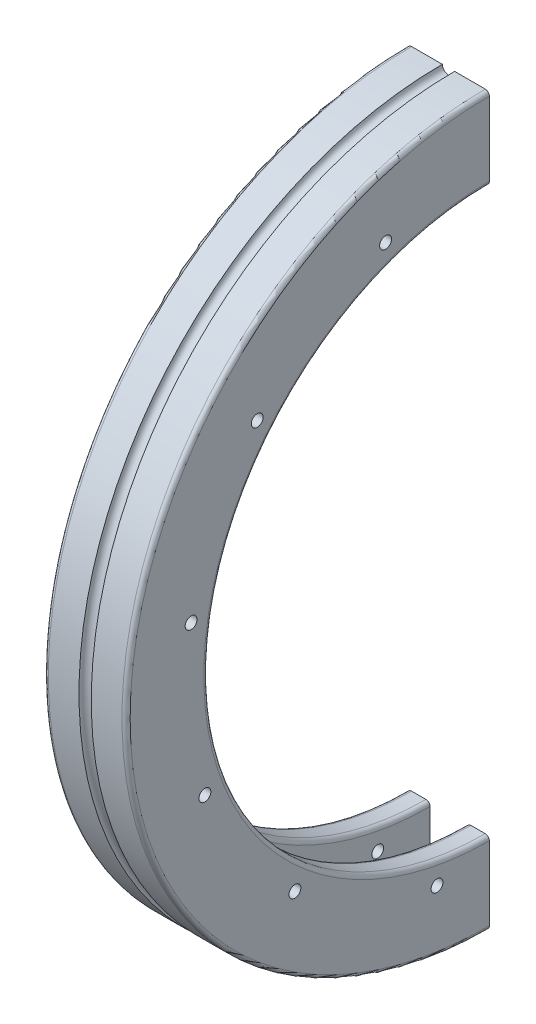
ISO-10303-21;
HEADER;
FILE_DESCRIPTION(('STEP AP214'),'2;1');
FILE_NAME('part.step','',(''),(''),'','','');
FILE_SCHEMA(('AUTOMOTIVE_DESIGN { 1 0 10303 214 1 1 1 1 }'));
ENDSEC;
DATA;
#1=APPLICATION_CONTEXT('core data for automotive mechanical design processes');
#2=APPLICATION_PROTOCOL_DEFINITION('international standard','automotive_design',2000,#1);
#3=PRODUCT_CONTEXT('',#1,'mechanical');
#4=PRODUCT('Part','Part','',(#3));
#5=PRODUCT_RELATED_PRODUCT_CATEGORY('part','',(#4));
#6=PRODUCT_DEFINITION_FORMATION('','',#4);
#7=PRODUCT_DEFINITION_CONTEXT('part definition',#1,'design');
#8=PRODUCT_DEFINITION('design','',#6,#7);
#9=PRODUCT_DEFINITION_SHAPE('','',#8);
#10=(LENGTH_UNIT() NAMED_UNIT(*) SI_UNIT(.MILLI.,.METRE.));
#11=(NAMED_UNIT(*) PLANE_ANGLE_UNIT() SI_UNIT($,.RADIAN.));
#12=(NAMED_UNIT(*) SI_UNIT($,.STERADIAN.) SOLID_ANGLE_UNIT());
#13=UNCERTAINTY_MEASURE_WITH_UNIT(LENGTH_MEASURE(1.E-05),#10,'distance_accuracy_value','');
#14=(GEOMETRIC_REPRESENTATION_CONTEXT(3) GLOBAL_UNCERTAINTY_ASSIGNED_CONTEXT((#13)) GLOBAL_UNIT_ASSIGNED_CONTEXT((#10,
#11,#12)) REPRESENTATION_CONTEXT('',''));
#15=CARTESIAN_POINT('',(0.,0.,0.));
#16=DIRECTION('',(0.,0.,1.));
#17=DIRECTION('',(1.,0.,0.));
#18=AXIS2_PLACEMENT_3D('',#15,#16,#17);
#19=CARTESIAN_POINT('',(-85.3849310544505,-58.8378893888762,0.));
#20=DIRECTION('',(-1.,0.,0.));
#21=DIRECTION('',(0.,0.,1.));
#22=AXIS2_PLACEMENT_3D('',#19,#20,#21);
#23=CYLINDRICAL_SURFACE('',#22,68.7840813761044);
#24=DIRECTION('',(1.,0.,0.));
#25=VECTOR('',#24,1.);
#26=CARTESIAN_POINT('',(-7.40458995500115,9.94619198722817,0.));
#27=LINE('',#26,#25);
#28=CARTESIAN_POINT('',(-6.40458995500115,9.94619198722817,0.));
#29=VERTEX_POINT('',#28);
#30=CARTESIAN_POINT('',(-2.90458995500115,9.94619198722817,0.));
#31=VERTEX_POINT('',#30);
#32=EDGE_CURVE('E158',#29,#31,#27,.T.);
#33=ORIENTED_EDGE('',*,*,#32,.T.);
#34=CARTESIAN_POINT('',(-2.90458995500115,-58.8378893888762,0.));
#35=DIRECTION('',(-1.,0.,0.));
#36=DIRECTION('',(0.,0.,1.));
#37=AXIS2_PLACEMENT_3D('',#34,#35,#36);
#38=CIRCLE('',#37,68.7840813761044);
#39=CARTESIAN_POINT('',(-2.90458995500115,-127.621970764981,-4.80316673068272E-13));
#40=VERTEX_POINT('',#39);
#41=EDGE_CURVE('E40',#31,#40,#38,.F.);
#42=ORIENTED_EDGE('',*,*,#41,.T.);
#43=DIRECTION('',(1.,0.,0.));
#44=VECTOR('',#43,1.);
#45=CARTESIAN_POINT('',(-7.40458995500115,-127.621970764981,-4.80316673068272E-13));
#46=LINE('',#45,#44);
#47=CARTESIAN_POINT('',(-6.40458995500115,-127.621970764981,-4.80316673068272E-13));
#48=VERTEX_POINT('',#47);
#49=EDGE_CURVE('E192',#48,#40,#46,.T.);
#50=ORIENTED_EDGE('',*,*,#49,.F.);
#51=CARTESIAN_POINT('',(-6.40458995500115,-58.8378893888762,0.));
#52=DIRECTION('',(1.,0.,0.));
#53=DIRECTION('',(0.,0.,-1.));
#54=AXIS2_PLACEMENT_3D('',#51,#52,#53);
#55=CIRCLE('',#54,68.7840813761044);
#56=EDGE_CURVE('E265',#48,#29,#55,.F.);
#57=ORIENTED_EDGE('',*,*,#56,.T.);
#58=EDGE_LOOP('',(#33,#42,#50,#57));
#59=FACE_BOUND('',#58,.T.);
#60=ADVANCED_FACE('F32',(#59),#23,.F.);
#61=CARTESIAN_POINT('',(-1.90458995500115,-127.621970764981,-4.80316673068272E-13));
#62=DIRECTION('',(-1.,0.,0.));
#63=DIRECTION('',(0.,0.,1.));
#64=AXIS2_PLACEMENT_3D('',#61,#62,#63);
#65=PLANE('',#64);
#66=CARTESIAN_POINT('',(-1.90458995500115,-131.72368400921,12.7911015660898));
#67=DIRECTION('',(-1.,0.,0.));
#68=DIRECTION('',(0.,0.,1.));
#69=AXIS2_PLACEMENT_3D('',#66,#67,#68);
#70=CIRCLE('',#69,1.45000000000001);
#71=CARTESIAN_POINT('',(-1.90458995500115,-131.72368400921,14.2411015660898));
#72=VERTEX_POINT('',#71);
#73=EDGE_CURVE('E339',#72,#72,#70,.T.);
#74=ORIENTED_EDGE('',*,*,#73,.T.);
#75=EDGE_LOOP('',(#74));
#76=FACE_BOUND('',#75,.T.);
#77=CARTESIAN_POINT('',(-1.90458995500115,-84.2032213989773,69.5169039305136));
#78=DIRECTION('',(-1.,0.,0.));
#79=DIRECTION('',(0.,0.,1.));
#80=AXIS2_PLACEMENT_3D('',#77,#78,#79);
#81=CIRCLE('',#80,1.45);
#82=CARTESIAN_POINT('',(-1.90458995500115,-84.2032213989773,70.9669039305136));
#83=VERTEX_POINT('',#82);
#84=EDGE_CURVE('E327',#83,#83,#81,.T.);
#85=ORIENTED_EDGE('',*,*,#84,.T.);
#86=EDGE_LOOP('',(#85));
#87=FACE_BOUND('',#86,.T.);
#88=CARTESIAN_POINT('',(-1.90458995500115,-11.3171642972111,56.7254853373894));
#89=DIRECTION('',(-1.,0.,0.));
#90=DIRECTION('',(0.,0.,1.));
#91=AXIS2_PLACEMENT_3D('',#88,#89,#90);
#92=CIRCLE('',#91,1.45);
#93=CARTESIAN_POINT('',(-1.90458995500115,-11.3171642972111,58.1754853373894));
#94=VERTEX_POINT('',#93);
#95=EDGE_CURVE('E315',#94,#94,#92,.T.);
#96=ORIENTED_EDGE('',*,*,#95,.T.);
#97=EDGE_LOOP('',(#96));
#98=FACE_BOUND('',#97,.T.);
#99=CARTESIAN_POINT('',(-1.90458995500115,-46.0464247322688,72.8860647307753));
#100=DIRECTION('',(-1.,0.,0.));
#101=DIRECTION('',(0.,0.,1.));
#102=AXIS2_PLACEMENT_3D('',#99,#100,#101);
#103=CIRCLE('',#102,1.45);
#104=CARTESIAN_POINT('',(-1.90458995500115,-46.0464247322688,74.3360647307753));
#105=VERTEX_POINT('',#104);
#106=EDGE_CURVE('E303',#105,#105,#103,.T.);
#107=ORIENTED_EDGE('',*,*,#106,.T.);
#108=EDGE_LOOP('',(#107));
#109=FACE_BOUND('',#108,.T.);
#110=CARTESIAN_POINT('',(-1.90458995500115,-115.563436335731,47.5206515483554));
#111=DIRECTION('',(-1.,0.,0.));
#112=DIRECTION('',(0.,0.,1.));
#113=AXIS2_PLACEMENT_3D('',#110,#111,#112);
#114=CIRCLE('',#113,1.45000000000001);
#115=CARTESIAN_POINT('',(-1.90458995500115,-115.563436335731,48.9706515483554));
#116=VERTEX_POINT('',#115);
#117=EDGE_CURVE('E291',#116,#116,#114,.T.);
#118=ORIENTED_EDGE('',*,*,#117,.T.);
#119=EDGE_LOOP('',(#118));
#120=FACE_BOUND('',#119,.T.);
#121=CARTESIAN_POINT('',(-1.90458995500115,10.678964919648,25.3654680037135));
#122=DIRECTION('',(-1.,0.,0.));
#123=DIRECTION('',(0.,0.,1.));
#124=AXIS2_PLACEMENT_3D('',#121,#122,#123);
#125=CIRCLE('',#124,1.45);
#126=CARTESIAN_POINT('',(-1.90458995500115,10.678964919648,26.8154680037135));
#127=VERTEX_POINT('',#126);
#128=EDGE_CURVE('E278',#127,#127,#125,.T.);
#129=ORIENTED_EDGE('',*,*,#128,.T.);
#130=EDGE_LOOP('',(#129));
#131=FACE_BOUND('',#130,.T.);
#132=DIRECTION('',(0.,-1.,0.));
#133=VECTOR('',#132,1.);
#134=CARTESIAN_POINT('',(-1.90458995500115,-127.621970764981,-4.80316673068272E-13));
#135=LINE('',#134,#133);
#136=CARTESIAN_POINT('',(-1.90458995500115,-128.621970764981,-4.87299635745958E-13));
#137=VERTEX_POINT('',#136);
#138=CARTESIAN_POINT('',(-1.90458995500115,-138.837889388876,-5.58637014214901E-13));
#139=VERTEX_POINT('',#138);
#140=EDGE_CURVE('E194',#137,#139,#135,.T.);
#141=ORIENTED_EDGE('',*,*,#140,.F.);
#142=CARTESIAN_POINT('',(-1.90458995500115,-58.8378893888762,0.));
#143=DIRECTION('',(-1.,0.,0.));
#144=DIRECTION('',(0.,0.,1.));
#145=AXIS2_PLACEMENT_3D('',#142,#143,#144);
#146=CIRCLE('',#145,69.7840813761044);
#147=CARTESIAN_POINT('',(-1.90458995500115,10.9461919872282,0.));
#148=VERTEX_POINT('',#147);
#149=EDGE_CURVE('E154',#137,#148,#146,.T.);
#150=ORIENTED_EDGE('',*,*,#149,.T.);
#151=DIRECTION('',(0.,1.,0.));
#152=VECTOR('',#151,1.);
#153=CARTESIAN_POINT('',(-1.90458995500115,9.94619198722817,0.));
#154=LINE('',#153,#152);
#155=CARTESIAN_POINT('',(-1.90458995500115,21.1621106111238,0.));
#156=VERTEX_POINT('',#155);
#157=EDGE_CURVE('E148',#148,#156,#154,.T.);
#158=ORIENTED_EDGE('',*,*,#157,.T.);
#159=CARTESIAN_POINT('',(-1.90458995500115,-58.8378893888762,0.));
#160=DIRECTION('',(-1.,0.,0.));
#161=DIRECTION('',(0.,0.,1.));
#162=AXIS2_PLACEMENT_3D('',#159,#160,#161);
#163=CIRCLE('',#162,80.);
#164=EDGE_CURVE('E151',#139,#156,#163,.T.);
#165=ORIENTED_EDGE('',*,*,#164,.F.);
#166=EDGE_LOOP('',(#141,#150,#158,#165));
#167=FACE_BOUND('',#166,.T.);
#168=ADVANCED_FACE('F150',(#76,#87,#98,#109,#120,#131,#167),#65,.F.);
#169=CARTESIAN_POINT('',(-85.3849310544505,-58.8378893888762,0.));
#170=DIRECTION('',(-1.,0.,0.));
#171=DIRECTION('',(0.,0.,1.));
#172=AXIS2_PLACEMENT_3D('',#169,#170,#171);
#173=CYLINDRICAL_SURFACE('',#172,80.);
#174=CARTESIAN_POINT('',(7.09541004499885,-58.8378893888762,0.));
#175=DIRECTION('',(-1.,0.,0.));
#176=DIRECTION('',(0.,0.,1.));
#177=AXIS2_PLACEMENT_3D('',#174,#175,#176);
#178=CIRCLE('',#177,80.);
#179=CARTESIAN_POINT('',(7.09541004499885,-138.837889388876,-5.58637014214901E-13));
#180=VERTEX_POINT('',#179);
#181=CARTESIAN_POINT('',(7.09541004499885,21.1621106111238,0.));
#182=VERTEX_POINT('',#181);
#183=EDGE_CURVE('E167',#180,#182,#178,.T.);
#184=ORIENTED_EDGE('',*,*,#183,.F.);
#185=DIRECTION('',(1.,0.,0.));
#186=VECTOR('',#185,1.);
#187=CARTESIAN_POINT('',(-1.90458995500115,-138.837889388876,-5.58637014214901E-13));
#188=LINE('',#187,#186);
#189=EDGE_CURVE('E165',#139,#180,#188,.T.);
#190=ORIENTED_EDGE('',*,*,#189,.F.);
#191=ORIENTED_EDGE('',*,*,#164,.T.);
#192=DIRECTION('',(1.,0.,0.));
#193=VECTOR('',#192,1.);
#194=CARTESIAN_POINT('',(-1.90458995500115,21.1621106111238,0.));
#195=LINE('',#194,#193);
#196=EDGE_CURVE('E157',#156,#182,#195,.T.);
#197=ORIENTED_EDGE('',*,*,#196,.T.);
#198=EDGE_LOOP('',(#184,#190,#191,#197));
#199=FACE_BOUND('',#198,.T.);
#200=ADVANCED_FACE('F162',(#199),#173,.F.);
#201=CARTESIAN_POINT('',(7.09541004499885,-138.837889388876,-5.58637014214901E-13));
#202=DIRECTION('',(1.,0.,0.));
#203=DIRECTION('',(0.,0.,-1.));
#204=AXIS2_PLACEMENT_3D('',#201,#202,#203);
#205=PLANE('',#204);
#206=CARTESIAN_POINT('',(7.09541004499885,-131.72368400921,12.7911015660898));
#207=DIRECTION('',(1.,0.,0.));
#208=DIRECTION('',(0.,0.,-1.));
#209=AXIS2_PLACEMENT_3D('',#206,#207,#208);
#210=CIRCLE('',#209,1.45000000000001);
#211=CARTESIAN_POINT('',(7.09541004499885,-131.72368400921,11.3411015660898));
#212=VERTEX_POINT('',#211);
#213=EDGE_CURVE('E342',#212,#212,#210,.T.);
#214=ORIENTED_EDGE('',*,*,#213,.T.);
#215=EDGE_LOOP('',(#214));
#216=FACE_BOUND('',#215,.T.);
#217=CARTESIAN_POINT('',(7.09541004499885,-84.2032213989773,69.5169039305136));
#218=DIRECTION('',(1.,0.,0.));
#219=DIRECTION('',(0.,0.,-1.));
#220=AXIS2_PLACEMENT_3D('',#217,#218,#219);
#221=CIRCLE('',#220,1.45);
#222=CARTESIAN_POINT('',(7.09541004499885,-84.2032213989773,68.0669039305136));
#223=VERTEX_POINT('',#222);
#224=EDGE_CURVE('E330',#223,#223,#221,.T.);
#225=ORIENTED_EDGE('',*,*,#224,.T.);
#226=EDGE_LOOP('',(#225));
#227=FACE_BOUND('',#226,.T.);
#228=CARTESIAN_POINT('',(7.09541004499885,-11.3171642972111,56.7254853373894));
#229=DIRECTION('',(1.,0.,0.));
#230=DIRECTION('',(0.,0.,-1.));
#231=AXIS2_PLACEMENT_3D('',#228,#229,#230);
#232=CIRCLE('',#231,1.45);
#233=CARTESIAN_POINT('',(7.09541004499885,-11.3171642972111,55.2754853373894));
#234=VERTEX_POINT('',#233);
#235=EDGE_CURVE('E318',#234,#234,#232,.T.);
#236=ORIENTED_EDGE('',*,*,#235,.T.);
#237=EDGE_LOOP('',(#236));
#238=FACE_BOUND('',#237,.T.);
#239=CARTESIAN_POINT('',(7.09541004499885,-46.0464247322688,72.8860647307753));
#240=DIRECTION('',(1.,0.,0.));
#241=DIRECTION('',(0.,0.,-1.));
#242=AXIS2_PLACEMENT_3D('',#239,#240,#241);
#243=CIRCLE('',#242,1.45);
#244=CARTESIAN_POINT('',(7.09541004499885,-46.0464247322688,71.4360647307753));
#245=VERTEX_POINT('',#244);
#246=EDGE_CURVE('E306',#245,#245,#243,.T.);
#247=ORIENTED_EDGE('',*,*,#246,.T.);
#248=EDGE_LOOP('',(#247));
#249=FACE_BOUND('',#248,.T.);
#250=CARTESIAN_POINT('',(7.09541004499885,-115.563436335731,47.5206515483554));
#251=DIRECTION('',(1.,0.,0.));
#252=DIRECTION('',(0.,0.,-1.));
#253=AXIS2_PLACEMENT_3D('',#250,#251,#252);
#254=CIRCLE('',#253,1.45000000000001);
#255=CARTESIAN_POINT('',(7.09541004499885,-115.563436335731,46.0706515483554));
#256=VERTEX_POINT('',#255);
#257=EDGE_CURVE('E294',#256,#256,#254,.T.);
#258=ORIENTED_EDGE('',*,*,#257,.T.);
#259=EDGE_LOOP('',(#258));
#260=FACE_BOUND('',#259,.T.);
#261=CARTESIAN_POINT('',(7.09541004499885,10.678964919648,25.3654680037135));
#262=DIRECTION('',(1.,0.,0.));
#263=DIRECTION('',(0.,0.,-1.));
#264=AXIS2_PLACEMENT_3D('',#261,#262,#263);
#265=CIRCLE('',#264,1.45);
#266=CARTESIAN_POINT('',(7.09541004499885,10.678964919648,23.9154680037135));
#267=VERTEX_POINT('',#266);
#268=EDGE_CURVE('E280',#267,#267,#265,.T.);
#269=ORIENTED_EDGE('',*,*,#268,.T.);
#270=EDGE_LOOP('',(#269));
#271=FACE_BOUND('',#270,.T.);
#272=DIRECTION('',(0.,-1.,0.));
#273=VECTOR('',#272,1.);
#274=CARTESIAN_POINT('',(7.09541004499885,21.1621106111238,0.));
#275=LINE('',#274,#273);
#276=CARTESIAN_POINT('',(7.09541004499886,10.9461919872282,0.));
#277=VERTEX_POINT('',#276);
#278=EDGE_CURVE('E171',#182,#277,#275,.T.);
#279=ORIENTED_EDGE('',*,*,#278,.T.);
#280=CARTESIAN_POINT('',(7.09541004499885,-58.8378893888762,0.));
#281=DIRECTION('',(1.,0.,0.));
#282=DIRECTION('',(0.,0.,-1.));
#283=AXIS2_PLACEMENT_3D('',#280,#281,#282);
#284=CIRCLE('',#283,69.7840813761044);
#285=CARTESIAN_POINT('',(7.09541004499886,-128.621970764981,-4.87299635745958E-13));
#286=VERTEX_POINT('',#285);
#287=EDGE_CURVE('E47',#277,#286,#284,.T.);
#288=ORIENTED_EDGE('',*,*,#287,.T.);
#289=DIRECTION('',(0.,1.,0.));
#290=VECTOR('',#289,1.);
#291=CARTESIAN_POINT('',(7.09541004499885,-138.837889388876,-5.58637014214901E-13));
#292=LINE('',#291,#290);
#293=EDGE_CURVE('E197',#180,#286,#292,.T.);
#294=ORIENTED_EDGE('',*,*,#293,.F.);
#295=ORIENTED_EDGE('',*,*,#183,.T.);
#296=EDGE_LOOP('',(#279,#288,#294,#295));
#297=FACE_BOUND('',#296,.T.);
#298=ADVANCED_FACE('F408',(#216,#227,#238,#249,#260,#271,#297),#205,.F.);
#299=CARTESIAN_POINT('',(-85.3849310544505,-58.8378893888762,0.));
#300=DIRECTION('',(-1.,0.,0.));
#301=DIRECTION('',(0.,0.,1.));
#302=AXIS2_PLACEMENT_3D('',#299,#300,#301);
#303=CYLINDRICAL_SURFACE('',#302,68.7840813761044);
#304=DIRECTION('',(1.,0.,0.));
#305=VECTOR('',#304,1.);
#306=CARTESIAN_POINT('',(7.09541004499886,9.94619198722817,0.));
#307=LINE('',#306,#305);
#308=CARTESIAN_POINT('',(8.09541004499885,9.94619198722817,0.));
#309=VERTEX_POINT('',#308);
#310=CARTESIAN_POINT('',(11.5954100449989,9.94619198722816,0.));
#311=VERTEX_POINT('',#310);
#312=EDGE_CURVE('E173',#309,#311,#307,.T.);
#313=ORIENTED_EDGE('',*,*,#312,.T.);
#314=CARTESIAN_POINT('',(11.5954100449989,-58.8378893888762,0.));
#315=DIRECTION('',(-1.,0.,0.));
#316=DIRECTION('',(0.,0.,1.));
#317=AXIS2_PLACEMENT_3D('',#314,#315,#316);
#318=CIRCLE('',#317,68.7840813761044);
#319=CARTESIAN_POINT('',(11.5954100449989,-127.621970764981,-4.80316673068272E-13));
#320=VERTEX_POINT('',#319);
#321=EDGE_CURVE('E254',#311,#320,#318,.F.);
#322=ORIENTED_EDGE('',*,*,#321,.T.);
#323=DIRECTION('',(1.,0.,0.));
#324=VECTOR('',#323,1.);
#325=CARTESIAN_POINT('',(7.09541004499886,-127.621970764981,-4.80316673068272E-13));
#326=LINE('',#325,#324);
#327=CARTESIAN_POINT('',(8.09541004499885,-127.621970764981,-4.80316673068272E-13));
#328=VERTEX_POINT('',#327);
#329=EDGE_CURVE('E199',#328,#320,#326,.T.);
#330=ORIENTED_EDGE('',*,*,#329,.F.);
#331=CARTESIAN_POINT('',(8.09541004499885,-58.8378893888762,0.));
#332=DIRECTION('',(1.,0.,0.));
#333=DIRECTION('',(0.,0.,-1.));
#334=AXIS2_PLACEMENT_3D('',#331,#332,#333);
#335=CIRCLE('',#334,68.7840813761044);
#336=EDGE_CURVE('E251',#328,#309,#335,.F.);
#337=ORIENTED_EDGE('',*,*,#336,.T.);
#338=EDGE_LOOP('',(#313,#322,#330,#337));
#339=FACE_BOUND('',#338,.T.);
#340=ADVANCED_FACE('F404',(#339),#303,.F.);
#341=CARTESIAN_POINT('',(12.5954100449989,-127.621970764981,-4.80316673068272E-13));
#342=DIRECTION('',(-1.,0.,0.));
#343=DIRECTION('',(0.,0.,1.));
#344=AXIS2_PLACEMENT_3D('',#341,#342,#343);
#345=PLANE('',#344);
#346=CARTESIAN_POINT('',(12.5954100449989,-131.72368400921,12.7911015660898));
#347=DIRECTION('',(-1.,0.,0.));
#348=DIRECTION('',(0.,0.,1.));
#349=AXIS2_PLACEMENT_3D('',#346,#347,#348);
#350=CIRCLE('',#349,1.45000000000001);
#351=CARTESIAN_POINT('',(12.5954100449989,-131.72368400921,14.2411015660898));
#352=VERTEX_POINT('',#351);
#353=EDGE_CURVE('E345',#352,#352,#350,.T.);
#354=ORIENTED_EDGE('',*,*,#353,.T.);
#355=EDGE_LOOP('',(#354));
#356=FACE_BOUND('',#355,.T.);
#357=CARTESIAN_POINT('',(12.5954100449989,-84.2032213989773,69.5169039305136));
#358=DIRECTION('',(-1.,0.,0.));
#359=DIRECTION('',(0.,0.,1.));
#360=AXIS2_PLACEMENT_3D('',#357,#358,#359);
#361=CIRCLE('',#360,1.45);
#362=CARTESIAN_POINT('',(12.5954100449989,-84.2032213989773,70.9669039305136));
#363=VERTEX_POINT('',#362);
#364=EDGE_CURVE('E333',#363,#363,#361,.T.);
#365=ORIENTED_EDGE('',*,*,#364,.T.);
#366=EDGE_LOOP('',(#365));
#367=FACE_BOUND('',#366,.T.);
#368=CARTESIAN_POINT('',(12.5954100449989,-11.3171642972111,56.7254853373894));
#369=DIRECTION('',(-1.,0.,0.));
#370=DIRECTION('',(0.,0.,1.));
#371=AXIS2_PLACEMENT_3D('',#368,#369,#370);
#372=CIRCLE('',#371,1.45);
#373=CARTESIAN_POINT('',(12.5954100449989,-11.3171642972111,58.1754853373894));
#374=VERTEX_POINT('',#373);
#375=EDGE_CURVE('E321',#374,#374,#372,.T.);
#376=ORIENTED_EDGE('',*,*,#375,.T.);
#377=EDGE_LOOP('',(#376));
#378=FACE_BOUND('',#377,.T.);
#379=CARTESIAN_POINT('',(12.5954100449989,-46.0464247322688,72.8860647307753));
#380=DIRECTION('',(-1.,0.,0.));
#381=DIRECTION('',(0.,0.,1.));
#382=AXIS2_PLACEMENT_3D('',#379,#380,#381);
#383=CIRCLE('',#382,1.45);
#384=CARTESIAN_POINT('',(12.5954100449989,-46.0464247322688,74.3360647307753));
#385=VERTEX_POINT('',#384);
#386=EDGE_CURVE('E309',#385,#385,#383,.T.);
#387=ORIENTED_EDGE('',*,*,#386,.T.);
#388=EDGE_LOOP('',(#387));
#389=FACE_BOUND('',#388,.T.);
#390=CARTESIAN_POINT('',(12.5954100449989,-115.563436335731,47.5206515483554));
#391=DIRECTION('',(-1.,0.,0.));
#392=DIRECTION('',(0.,0.,1.));
#393=AXIS2_PLACEMENT_3D('',#390,#391,#392);
#394=CIRCLE('',#393,1.45000000000001);
#395=CARTESIAN_POINT('',(12.5954100449989,-115.563436335731,48.9706515483554));
#396=VERTEX_POINT('',#395);
#397=EDGE_CURVE('E297',#396,#396,#394,.T.);
#398=ORIENTED_EDGE('',*,*,#397,.T.);
#399=EDGE_LOOP('',(#398));
#400=FACE_BOUND('',#399,.T.);
#401=CARTESIAN_POINT('',(12.5954100449989,10.678964919648,25.3654680037135));
#402=DIRECTION('',(-1.,0.,0.));
#403=DIRECTION('',(0.,0.,1.));
#404=AXIS2_PLACEMENT_3D('',#401,#402,#403);
#405=CIRCLE('',#404,1.45);
#406=CARTESIAN_POINT('',(12.5954100449989,10.678964919648,26.8154680037135));
#407=VERTEX_POINT('',#406);
#408=EDGE_CURVE('E285',#407,#407,#405,.T.);
#409=ORIENTED_EDGE('',*,*,#408,.T.);
#410=EDGE_LOOP('',(#409));
#411=FACE_BOUND('',#410,.T.);
#412=DIRECTION('',(0.,-1.,0.));
#413=VECTOR('',#412,1.);
#414=CARTESIAN_POINT('',(12.5954100449989,-127.621970764981,-4.80316673068272E-13));
#415=LINE('',#414,#413);
#416=CARTESIAN_POINT('',(12.5954100449989,-128.621970764981,-4.87299635745958E-13));
#417=VERTEX_POINT('',#416);
#418=CARTESIAN_POINT('',(12.5954100449989,-146.621970764981,-6.12992963944311E-13));
#419=VERTEX_POINT('',#418);
#420=EDGE_CURVE('E202',#417,#419,#415,.T.);
#421=ORIENTED_EDGE('',*,*,#420,.F.);
#422=CARTESIAN_POINT('',(12.5954100449989,-58.8378893888762,0.));
#423=DIRECTION('',(-1.,0.,0.));
#424=DIRECTION('',(0.,0.,1.));
#425=AXIS2_PLACEMENT_3D('',#422,#423,#424);
#426=CIRCLE('',#425,69.7840813761044);
#427=CARTESIAN_POINT('',(12.5954100449989,10.9461919872282,0.));
#428=VERTEX_POINT('',#427);
#429=EDGE_CURVE('E240',#417,#428,#426,.T.);
#430=ORIENTED_EDGE('',*,*,#429,.T.);
#431=DIRECTION('',(0.,1.,0.));
#432=VECTOR('',#431,1.);
#433=CARTESIAN_POINT('',(12.5954100449989,9.94619198722816,0.));
#434=LINE('',#433,#432);
#435=CARTESIAN_POINT('',(12.5954100449989,28.9461919872282,0.));
#436=VERTEX_POINT('',#435);
#437=EDGE_CURVE('E179',#428,#436,#434,.T.);
#438=ORIENTED_EDGE('',*,*,#437,.T.);
#439=CARTESIAN_POINT('',(12.5954100449989,-58.8378893888762,0.));
#440=DIRECTION('',(-1.,0.,0.));
#441=DIRECTION('',(0.,0.,1.));
#442=AXIS2_PLACEMENT_3D('',#439,#440,#441);
#443=CIRCLE('',#442,87.7840813761044);
#444=EDGE_CURVE('E226',#436,#419,#443,.F.);
#445=ORIENTED_EDGE('',*,*,#444,.T.);
#446=EDGE_LOOP('',(#421,#430,#438,#445));
#447=FACE_BOUND('',#446,.T.);
#448=ADVANCED_FACE('F400',(#356,#367,#378,#389,#400,#411,#447),#345,.F.);
#449=CARTESIAN_POINT('',(-85.3849310544505,-58.8378893888762,0.));
#450=DIRECTION('',(-1.,0.,0.));
#451=DIRECTION('',(0.,0.,1.));
#452=AXIS2_PLACEMENT_3D('',#449,#450,#451);
#453=CYLINDRICAL_SURFACE('',#452,88.7840813761044);
#454=DIRECTION('',(-1.,0.,0.));
#455=VECTOR('',#454,1.);
#456=CARTESIAN_POINT('',(4.09541004499885,-147.621970764981,-6.19975926621997E-13));
#457=LINE('',#456,#455);
#458=CARTESIAN_POINT('',(11.5954100449989,-147.621970764981,-6.19975926621997E-13));
#459=VERTEX_POINT('',#458);
#460=CARTESIAN_POINT('',(4.09541004499885,-147.621970764981,-6.19975926621997E-13));
#461=VERTEX_POINT('',#460);
#462=EDGE_CURVE('E204',#459,#461,#457,.T.);
#463=ORIENTED_EDGE('',*,*,#462,.F.);
#464=CARTESIAN_POINT('',(11.5954100449989,-58.8378893888762,0.));
#465=DIRECTION('',(-1.,0.,0.));
#466=DIRECTION('',(0.,0.,1.));
#467=AXIS2_PLACEMENT_3D('',#464,#465,#466);
#468=CIRCLE('',#467,88.7840813761044);
#469=CARTESIAN_POINT('',(11.5954100449989,29.9461919872282,0.));
#470=VERTEX_POINT('',#469);
#471=EDGE_CURVE('E166',#459,#470,#468,.T.);
#472=ORIENTED_EDGE('',*,*,#471,.T.);
#473=DIRECTION('',(-1.,0.,0.));
#474=VECTOR('',#473,1.);
#475=CARTESIAN_POINT('',(4.09541004499885,29.9461919872282,0.));
#476=LINE('',#475,#474);
#477=CARTESIAN_POINT('',(4.09541004499885,29.9461919872282,0.));
#478=VERTEX_POINT('',#477);
#479=EDGE_CURVE('E181',#470,#478,#476,.T.);
#480=ORIENTED_EDGE('',*,*,#479,.T.);
#481=CARTESIAN_POINT('',(4.09541004499886,-58.8378893888762,0.));
#482=DIRECTION('',(-1.,0.,0.));
#483=DIRECTION('',(0.,0.,1.));
#484=AXIS2_PLACEMENT_3D('',#481,#482,#483);
#485=CIRCLE('',#484,88.7840813761044);
#486=EDGE_CURVE('E217',#461,#478,#485,.T.);
#487=ORIENTED_EDGE('',*,*,#486,.F.);
#488=EDGE_LOOP('',(#463,#472,#480,#487));
#489=FACE_BOUND('',#488,.T.);
#490=ADVANCED_FACE('F396',(#489),#453,.T.);
#491=CARTESIAN_POINT('',(2.59541004499885,-58.8378893888762,0.));
#492=DIRECTION('',(-1.,0.,0.));
#493=DIRECTION('',(0.,0.,1.));
#494=AXIS2_PLACEMENT_3D('',#491,#492,#493);
#495=TOROIDAL_SURFACE('',#494,88.7840813761044,1.5);
#496=CARTESIAN_POINT('',(1.09541004499886,-58.8378893888762,0.));
#497=DIRECTION('',(-1.,0.,0.));
#498=DIRECTION('',(0.,0.,1.));
#499=AXIS2_PLACEMENT_3D('',#496,#497,#498);
#500=CIRCLE('',#499,88.7840813761044);
#501=CARTESIAN_POINT('',(1.09541004499885,-147.621970764981,-6.19975926621997E-13));
#502=VERTEX_POINT('',#501);
#503=CARTESIAN_POINT('',(1.09541004499885,29.9461919872282,0.));
#504=VERTEX_POINT('',#503);
#505=EDGE_CURVE('E215',#502,#504,#500,.T.);
#506=ORIENTED_EDGE('',*,*,#505,.F.);
#507=CARTESIAN_POINT('',(2.59541004499885,-147.621970764981,-6.19975926621997E-13));
#508=DIRECTION('',(0.,0.,1.));
#509=DIRECTION('',(1.,0.,0.));
#510=AXIS2_PLACEMENT_3D('',#507,#508,#509);
#511=CIRCLE('',#510,1.5);
#512=EDGE_CURVE('E206',#461,#502,#511,.T.);
#513=ORIENTED_EDGE('',*,*,#512,.F.);
#514=ORIENTED_EDGE('',*,*,#486,.T.);
#515=CARTESIAN_POINT('',(2.59541004499885,29.9461919872282,0.));
#516=DIRECTION('',(0.,0.,-1.));
#517=DIRECTION('',(1.,0.,0.));
#518=AXIS2_PLACEMENT_3D('',#515,#516,#517);
#519=CIRCLE('',#518,1.5);
#520=EDGE_CURVE('E183',#478,#504,#519,.T.);
#521=ORIENTED_EDGE('',*,*,#520,.T.);
#522=EDGE_LOOP('',(#506,#513,#514,#521));
#523=FACE_BOUND('',#522,.T.);
#524=ADVANCED_FACE('F392',(#523),#495,.F.);
#525=CARTESIAN_POINT('',(-85.3849310544505,-58.8378893888762,0.));
#526=DIRECTION('',(-1.,0.,0.));
#527=DIRECTION('',(0.,0.,1.));
#528=AXIS2_PLACEMENT_3D('',#525,#526,#527);
#529=CYLINDRICAL_SURFACE('',#528,88.7840813761044);
#530=DIRECTION('',(-1.,0.,0.));
#531=VECTOR('',#530,1.);
#532=CARTESIAN_POINT('',(-7.40458995500115,29.9461919872282,0.));
#533=LINE('',#532,#531);
#534=CARTESIAN_POINT('',(-6.40458995500115,29.9461919872282,0.));
#535=VERTEX_POINT('',#534);
#536=EDGE_CURVE('E186',#504,#535,#533,.T.);
#537=ORIENTED_EDGE('',*,*,#536,.T.);
#538=CARTESIAN_POINT('',(-6.40458995500115,-58.8378893888762,0.));
#539=DIRECTION('',(1.,0.,0.));
#540=DIRECTION('',(0.,0.,-1.));
#541=AXIS2_PLACEMENT_3D('',#538,#539,#540);
#542=CIRCLE('',#541,88.7840813761044);
#543=CARTESIAN_POINT('',(-6.40458995500115,-147.621970764981,-6.19975926621997E-13));
#544=VERTEX_POINT('',#543);
#545=EDGE_CURVE('E236',#535,#544,#542,.T.);
#546=ORIENTED_EDGE('',*,*,#545,.T.);
#547=DIRECTION('',(-1.,0.,0.));
#548=VECTOR('',#547,1.);
#549=CARTESIAN_POINT('',(-7.40458995500115,-147.621970764981,-6.19975926621997E-13));
#550=LINE('',#549,#548);
#551=EDGE_CURVE('E209',#502,#544,#550,.T.);
#552=ORIENTED_EDGE('',*,*,#551,.F.);
#553=ORIENTED_EDGE('',*,*,#505,.T.);
#554=EDGE_LOOP('',(#537,#546,#552,#553));
#555=FACE_BOUND('',#554,.T.);
#556=ADVANCED_FACE('F358',(#555),#529,.T.);
#557=CARTESIAN_POINT('',(-7.40458995500115,-127.621970764981,-4.80316673068272E-13));
#558=DIRECTION('',(1.,0.,0.));
#559=DIRECTION('',(0.,0.,-1.));
#560=AXIS2_PLACEMENT_3D('',#557,#558,#559);
#561=PLANE('',#560);
#562=CARTESIAN_POINT('',(-7.40458995500115,-131.72368400921,12.7911015660898));
#563=DIRECTION('',(-1.,0.,0.));
#564=DIRECTION('',(0.,0.,1.));
#565=AXIS2_PLACEMENT_3D('',#562,#563,#564);
#566=CIRCLE('',#565,1.45000000000001);
#567=CARTESIAN_POINT('',(-7.40458995500115,-131.72368400921,14.2411015660898));
#568=VERTEX_POINT('',#567);
#569=EDGE_CURVE('E348',#568,#568,#566,.T.);
#570=ORIENTED_EDGE('',*,*,#569,.F.);
#571=EDGE_LOOP('',(#570));
#572=FACE_BOUND('',#571,.T.);
#573=CARTESIAN_POINT('',(-7.40458995500115,-84.2032213989773,69.5169039305136));
#574=DIRECTION('',(-1.,0.,0.));
#575=DIRECTION('',(0.,0.,1.));
#576=AXIS2_PLACEMENT_3D('',#573,#574,#575);
#577=CIRCLE('',#576,1.45);
#578=CARTESIAN_POINT('',(-7.40458995500115,-84.2032213989773,70.9669039305136));
#579=VERTEX_POINT('',#578);
#580=EDGE_CURVE('E336',#579,#579,#577,.T.);
#581=ORIENTED_EDGE('',*,*,#580,.F.);
#582=EDGE_LOOP('',(#581));
#583=FACE_BOUND('',#582,.T.);
#584=CARTESIAN_POINT('',(-7.40458995500115,-11.3171642972111,56.7254853373894));
#585=DIRECTION('',(-1.,0.,0.));
#586=DIRECTION('',(0.,0.,1.));
#587=AXIS2_PLACEMENT_3D('',#584,#585,#586);
#588=CIRCLE('',#587,1.45);
#589=CARTESIAN_POINT('',(-7.40458995500115,-11.3171642972111,58.1754853373894));
#590=VERTEX_POINT('',#589);
#591=EDGE_CURVE('E324',#590,#590,#588,.T.);
#592=ORIENTED_EDGE('',*,*,#591,.F.);
#593=EDGE_LOOP('',(#592));
#594=FACE_BOUND('',#593,.T.);
#595=CARTESIAN_POINT('',(-7.40458995500115,-46.0464247322688,72.8860647307753));
#596=DIRECTION('',(-1.,0.,0.));
#597=DIRECTION('',(0.,0.,1.));
#598=AXIS2_PLACEMENT_3D('',#595,#596,#597);
#599=CIRCLE('',#598,1.45);
#600=CARTESIAN_POINT('',(-7.40458995500115,-46.0464247322688,74.3360647307753));
#601=VERTEX_POINT('',#600);
#602=EDGE_CURVE('E312',#601,#601,#599,.T.);
#603=ORIENTED_EDGE('',*,*,#602,.F.);
#604=EDGE_LOOP('',(#603));
#605=FACE_BOUND('',#604,.T.);
#606=CARTESIAN_POINT('',(-7.40458995500115,-115.563436335731,47.5206515483554));
#607=DIRECTION('',(-1.,0.,0.));
#608=DIRECTION('',(0.,0.,1.));
#609=AXIS2_PLACEMENT_3D('',#606,#607,#608);
#610=CIRCLE('',#609,1.45000000000001);
#611=CARTESIAN_POINT('',(-7.40458995500115,-115.563436335731,48.9706515483554));
#612=VERTEX_POINT('',#611);
#613=EDGE_CURVE('E300',#612,#612,#610,.T.);
#614=ORIENTED_EDGE('',*,*,#613,.F.);
#615=EDGE_LOOP('',(#614));
#616=FACE_BOUND('',#615,.T.);
#617=CARTESIAN_POINT('',(-7.40458995500115,10.678964919648,25.3654680037135));
#618=DIRECTION('',(-1.,0.,0.));
#619=DIRECTION('',(0.,0.,1.));
#620=AXIS2_PLACEMENT_3D('',#617,#618,#619);
#621=CIRCLE('',#620,1.45);
#622=CARTESIAN_POINT('',(-7.40458995500115,10.678964919648,26.8154680037135));
#623=VERTEX_POINT('',#622);
#624=EDGE_CURVE('E288',#623,#623,#621,.T.);
#625=ORIENTED_EDGE('',*,*,#624,.F.);
#626=EDGE_LOOP('',(#625));
#627=FACE_BOUND('',#626,.T.);
#628=DIRECTION('',(0.,-1.,0.));
#629=VECTOR('',#628,1.);
#630=CARTESIAN_POINT('',(-7.40458995500115,9.94619198722817,0.));
#631=LINE('',#630,#629);
#632=CARTESIAN_POINT('',(-7.40458995500115,28.9461919872282,0.));
#633=VERTEX_POINT('',#632);
#634=CARTESIAN_POINT('',(-7.40458995500115,10.9461919872282,0.));
#635=VERTEX_POINT('',#634);
#636=EDGE_CURVE('E189',#633,#635,#631,.T.);
#637=ORIENTED_EDGE('',*,*,#636,.T.);
#638=CARTESIAN_POINT('',(-7.40458995500115,-58.8378893888762,0.));
#639=DIRECTION('',(1.,0.,0.));
#640=DIRECTION('',(0.,0.,-1.));
#641=AXIS2_PLACEMENT_3D('',#638,#639,#640);
#642=CIRCLE('',#641,69.7840813761044);
#643=CARTESIAN_POINT('',(-7.40458995500115,-128.621970764981,-4.87299635745958E-13));
#644=VERTEX_POINT('',#643);
#645=EDGE_CURVE('E11',#635,#644,#642,.T.);
#646=ORIENTED_EDGE('',*,*,#645,.T.);
#647=DIRECTION('',(0.,1.,0.));
#648=VECTOR('',#647,1.);
#649=CARTESIAN_POINT('',(-7.40458995500115,-127.621970764981,-4.80316673068272E-13));
#650=LINE('',#649,#648);
#651=CARTESIAN_POINT('',(-7.40458995500115,-146.621970764981,-6.12992963944311E-13));
#652=VERTEX_POINT('',#651);
#653=EDGE_CURVE('E212',#652,#644,#650,.T.);
#654=ORIENTED_EDGE('',*,*,#653,.F.);
#655=CARTESIAN_POINT('',(-7.40458995500115,-58.8378893888762,0.));
#656=DIRECTION('',(1.,0.,0.));
#657=DIRECTION('',(0.,0.,-1.));
#658=AXIS2_PLACEMENT_3D('',#655,#656,#657);
#659=CIRCLE('',#658,87.7840813761044);
#660=EDGE_CURVE('E231',#652,#633,#659,.F.);
#661=ORIENTED_EDGE('',*,*,#660,.T.);
#662=EDGE_LOOP('',(#637,#646,#654,#661));
#663=FACE_BOUND('',#662,.T.);
#664=ADVANCED_FACE('F355',(#572,#583,#594,#605,#616,#627,#663),#561,.F.);
#665=CARTESIAN_POINT('',(2.59541004499885,-147.621970764981,-6.19975926621997E-13));
#666=DIRECTION('',(0.,0.,-1.));
#667=DIRECTION('',(1.,0.,0.));
#668=AXIS2_PLACEMENT_3D('',#665,#666,#667);
#669=PLANE('',#668);
#670=ORIENTED_EDGE('',*,*,#329,.T.);
#671=CARTESIAN_POINT('',(11.5954100449989,-128.621970764981,-4.87299635745958E-13));
#672=DIRECTION('',(0.,0.,-1.));
#673=DIRECTION('',(0.,1.,0.));
#674=AXIS2_PLACEMENT_3D('',#671,#672,#673);
#675=CIRCLE('',#674,1.);
#676=EDGE_CURVE('E261',#320,#417,#675,.T.);
#677=ORIENTED_EDGE('',*,*,#676,.T.);
#678=ORIENTED_EDGE('',*,*,#420,.T.);
#679=CARTESIAN_POINT('',(11.5954100449989,-146.621970764981,-6.12992963944311E-13));
#680=DIRECTION('',(0.,0.,-1.));
#681=DIRECTION('',(0.,1.,0.));
#682=AXIS2_PLACEMENT_3D('',#679,#680,#681);
#683=CIRCLE('',#682,1.);
#684=EDGE_CURVE('E229',#419,#459,#683,.T.);
#685=ORIENTED_EDGE('',*,*,#684,.T.);
#686=ORIENTED_EDGE('',*,*,#462,.T.);
#687=ORIENTED_EDGE('',*,*,#512,.T.);
#688=ORIENTED_EDGE('',*,*,#551,.T.);
#689=CARTESIAN_POINT('',(-6.40458995500115,-146.621970764981,-6.12992963944311E-13));
#690=DIRECTION('',(0.,0.,-1.));
#691=DIRECTION('',(0.,1.,0.));
#692=AXIS2_PLACEMENT_3D('',#689,#690,#691);
#693=CIRCLE('',#692,1.);
#694=EDGE_CURVE('E238',#544,#652,#693,.T.);
#695=ORIENTED_EDGE('',*,*,#694,.T.);
#696=ORIENTED_EDGE('',*,*,#653,.T.);
#697=CARTESIAN_POINT('',(-6.40458995500115,-128.621970764981,-4.87299635745958E-13));
#698=DIRECTION('',(0.,0.,-1.));
#699=DIRECTION('',(0.,1.,0.));
#700=AXIS2_PLACEMENT_3D('',#697,#698,#699);
#701=CIRCLE('',#700,1.);
#702=EDGE_CURVE('E256',#644,#48,#701,.T.);
#703=ORIENTED_EDGE('',*,*,#702,.T.);
#704=ORIENTED_EDGE('',*,*,#49,.T.);
#705=CARTESIAN_POINT('',(-2.90458995500115,-128.621970764981,-4.87299635745958E-13));
#706=DIRECTION('',(0.,0.,-1.));
#707=DIRECTION('',(0.,1.,0.));
#708=AXIS2_PLACEMENT_3D('',#705,#706,#707);
#709=CIRCLE('',#708,1.);
#710=EDGE_CURVE('E55',#40,#137,#709,.T.);
#711=ORIENTED_EDGE('',*,*,#710,.T.);
#712=ORIENTED_EDGE('',*,*,#140,.T.);
#713=ORIENTED_EDGE('',*,*,#189,.T.);
#714=ORIENTED_EDGE('',*,*,#293,.T.);
#715=CARTESIAN_POINT('',(8.09541004499885,-128.621970764981,-4.87299635745958E-13));
#716=DIRECTION('',(0.,0.,-1.));
#717=DIRECTION('',(0.,1.,0.));
#718=AXIS2_PLACEMENT_3D('',#715,#716,#717);
#719=CIRCLE('',#718,1.);
#720=EDGE_CURVE('E259',#286,#328,#719,.T.);
#721=ORIENTED_EDGE('',*,*,#720,.T.);
#722=EDGE_LOOP('',(#670,#677,#678,#685,#686,#687,#688,#695,#696,#703,#704,#711,#712,#713,#714,#721));
#723=FACE_BOUND('',#722,.T.);
#724=ADVANCED_FACE('F274',(#723),#669,.T.);
#725=CARTESIAN_POINT('',(2.59541004499885,29.9461919872282,0.));
#726=DIRECTION('',(0.,0.,1.));
#727=DIRECTION('',(1.,0.,0.));
#728=AXIS2_PLACEMENT_3D('',#725,#726,#727);
#729=PLANE('',#728);
#730=ORIENTED_EDGE('',*,*,#437,.F.);
#731=CARTESIAN_POINT('',(11.5954100449989,10.9461919872282,0.));
#732=DIRECTION('',(0.,0.,1.));
#733=DIRECTION('',(1.,0.,0.));
#734=AXIS2_PLACEMENT_3D('',#731,#732,#733);
#735=CIRCLE('',#734,1.);
#736=EDGE_CURVE('E249',#428,#311,#735,.F.);
#737=ORIENTED_EDGE('',*,*,#736,.T.);
#738=ORIENTED_EDGE('',*,*,#312,.F.);
#739=CARTESIAN_POINT('',(8.09541004499885,10.9461919872282,0.));
#740=DIRECTION('',(0.,0.,1.));
#741=DIRECTION('',(1.,0.,0.));
#742=AXIS2_PLACEMENT_3D('',#739,#740,#741);
#743=CIRCLE('',#742,1.);
#744=EDGE_CURVE('E247',#309,#277,#743,.F.);
#745=ORIENTED_EDGE('',*,*,#744,.T.);
#746=ORIENTED_EDGE('',*,*,#278,.F.);
#747=ORIENTED_EDGE('',*,*,#196,.F.);
#748=ORIENTED_EDGE('',*,*,#157,.F.);
#749=CARTESIAN_POINT('',(-2.90458995500115,10.9461919872282,0.));
#750=DIRECTION('',(0.,0.,1.));
#751=DIRECTION('',(1.,0.,0.));
#752=AXIS2_PLACEMENT_3D('',#749,#750,#751);
#753=CIRCLE('',#752,1.);
#754=EDGE_CURVE('E245',#148,#31,#753,.F.);
#755=ORIENTED_EDGE('',*,*,#754,.T.);
#756=ORIENTED_EDGE('',*,*,#32,.F.);
#757=CARTESIAN_POINT('',(-6.40458995500115,10.9461919872282,0.));
#758=DIRECTION('',(0.,0.,1.));
#759=DIRECTION('',(1.,0.,0.));
#760=AXIS2_PLACEMENT_3D('',#757,#758,#759);
#761=CIRCLE('',#760,1.);
#762=EDGE_CURVE('E243',#29,#635,#761,.F.);
#763=ORIENTED_EDGE('',*,*,#762,.T.);
#764=ORIENTED_EDGE('',*,*,#636,.F.);
#765=CARTESIAN_POINT('',(-6.40458995500115,28.9461919872282,0.));
#766=DIRECTION('',(0.,0.,1.));
#767=DIRECTION('',(1.,0.,0.));
#768=AXIS2_PLACEMENT_3D('',#765,#766,#767);
#769=CIRCLE('',#768,1.);
#770=EDGE_CURVE('E234',#633,#535,#769,.F.);
#771=ORIENTED_EDGE('',*,*,#770,.T.);
#772=ORIENTED_EDGE('',*,*,#536,.F.);
#773=ORIENTED_EDGE('',*,*,#520,.F.);
#774=ORIENTED_EDGE('',*,*,#479,.F.);
#775=CARTESIAN_POINT('',(11.5954100449989,28.9461919872282,0.));
#776=DIRECTION('',(0.,0.,1.));
#777=DIRECTION('',(1.,0.,0.));
#778=AXIS2_PLACEMENT_3D('',#775,#776,#777);
#779=CIRCLE('',#778,1.);
#780=EDGE_CURVE('E223',#470,#436,#779,.F.);
#781=ORIENTED_EDGE('',*,*,#780,.T.);
#782=EDGE_LOOP('',(#730,#737,#738,#745,#746,#747,#748,#755,#756,#763,#764,#771,#772,#773,#774,#781));
#783=FACE_BOUND('',#782,.T.);
#784=ADVANCED_FACE('F170',(#783),#729,.F.);
#785=CARTESIAN_POINT('',(12.9954100449989,10.678964919648,25.3654680037135));
#786=DIRECTION('',(-1.,0.,0.));
#787=DIRECTION('',(0.,0.,1.));
#788=AXIS2_PLACEMENT_3D('',#785,#786,#787);
#789=CYLINDRICAL_SURFACE('',#788,1.45);
#790=ORIENTED_EDGE('',*,*,#624,.T.);
#791=EDGE_LOOP('',(#790));
#792=FACE_BOUND('',#791,.T.);
#793=ORIENTED_EDGE('',*,*,#128,.F.);
#794=EDGE_LOOP('',(#793));
#795=FACE_BOUND('',#794,.T.);
#796=ADVANCED_FACE('F572',(#792,#795),#789,.F.);
#797=ORIENTED_EDGE('',*,*,#408,.F.);
#798=EDGE_LOOP('',(#797));
#799=FACE_BOUND('',#798,.T.);
#800=ORIENTED_EDGE('',*,*,#268,.F.);
#801=EDGE_LOOP('',(#800));
#802=FACE_BOUND('',#801,.T.);
#803=ADVANCED_FACE('F564',(#799,#802),#789,.F.);
#804=CARTESIAN_POINT('',(12.9954100449989,-115.563436335731,47.5206515483554));
#805=DIRECTION('',(-1.,0.,0.));
#806=DIRECTION('',(0.,0.,1.));
#807=AXIS2_PLACEMENT_3D('',#804,#805,#806);
#808=CYLINDRICAL_SURFACE('',#807,1.45000000000001);
#809=ORIENTED_EDGE('',*,*,#613,.T.);
#810=EDGE_LOOP('',(#809));
#811=FACE_BOUND('',#810,.T.);
#812=ORIENTED_EDGE('',*,*,#117,.F.);
#813=EDGE_LOOP('',(#812));
#814=FACE_BOUND('',#813,.T.);
#815=ADVANCED_FACE('F555',(#811,#814),#808,.F.);
#816=ORIENTED_EDGE('',*,*,#397,.F.);
#817=EDGE_LOOP('',(#816));
#818=FACE_BOUND('',#817,.T.);
#819=ORIENTED_EDGE('',*,*,#257,.F.);
#820=EDGE_LOOP('',(#819));
#821=FACE_BOUND('',#820,.T.);
#822=ADVANCED_FACE('F547',(#818,#821),#808,.F.);
#823=CARTESIAN_POINT('',(12.9954100449989,-46.0464247322688,72.8860647307753));
#824=DIRECTION('',(-1.,0.,0.));
#825=DIRECTION('',(0.,0.,1.));
#826=AXIS2_PLACEMENT_3D('',#823,#824,#825);
#827=CYLINDRICAL_SURFACE('',#826,1.45);
#828=ORIENTED_EDGE('',*,*,#602,.T.);
#829=EDGE_LOOP('',(#828));
#830=FACE_BOUND('',#829,.T.);
#831=ORIENTED_EDGE('',*,*,#106,.F.);
#832=EDGE_LOOP('',(#831));
#833=FACE_BOUND('',#832,.T.);
#834=ADVANCED_FACE('F538',(#830,#833),#827,.F.);
#835=ORIENTED_EDGE('',*,*,#386,.F.);
#836=EDGE_LOOP('',(#835));
#837=FACE_BOUND('',#836,.T.);
#838=ORIENTED_EDGE('',*,*,#246,.F.);
#839=EDGE_LOOP('',(#838));
#840=FACE_BOUND('',#839,.T.);
#841=ADVANCED_FACE('F530',(#837,#840),#827,.F.);
#842=CARTESIAN_POINT('',(12.9954100449989,-11.3171642972111,56.7254853373894));
#843=DIRECTION('',(-1.,0.,0.));
#844=DIRECTION('',(0.,0.,1.));
#845=AXIS2_PLACEMENT_3D('',#842,#843,#844);
#846=CYLINDRICAL_SURFACE('',#845,1.45);
#847=ORIENTED_EDGE('',*,*,#591,.T.);
#848=EDGE_LOOP('',(#847));
#849=FACE_BOUND('',#848,.T.);
#850=ORIENTED_EDGE('',*,*,#95,.F.);
#851=EDGE_LOOP('',(#850));
#852=FACE_BOUND('',#851,.T.);
#853=ADVANCED_FACE('F521',(#849,#852),#846,.F.);
#854=ORIENTED_EDGE('',*,*,#375,.F.);
#855=EDGE_LOOP('',(#854));
#856=FACE_BOUND('',#855,.T.);
#857=ORIENTED_EDGE('',*,*,#235,.F.);
#858=EDGE_LOOP('',(#857));
#859=FACE_BOUND('',#858,.T.);
#860=ADVANCED_FACE('F513',(#856,#859),#846,.F.);
#861=CARTESIAN_POINT('',(12.9954100449989,-84.2032213989773,69.5169039305136));
#862=DIRECTION('',(-1.,0.,0.));
#863=DIRECTION('',(0.,0.,1.));
#864=AXIS2_PLACEMENT_3D('',#861,#862,#863);
#865=CYLINDRICAL_SURFACE('',#864,1.45);
#866=ORIENTED_EDGE('',*,*,#580,.T.);
#867=EDGE_LOOP('',(#866));
#868=FACE_BOUND('',#867,.T.);
#869=ORIENTED_EDGE('',*,*,#84,.F.);
#870=EDGE_LOOP('',(#869));
#871=FACE_BOUND('',#870,.T.);
#872=ADVANCED_FACE('F504',(#868,#871),#865,.F.);
#873=ORIENTED_EDGE('',*,*,#364,.F.);
#874=EDGE_LOOP('',(#873));
#875=FACE_BOUND('',#874,.T.);
#876=ORIENTED_EDGE('',*,*,#224,.F.);
#877=EDGE_LOOP('',(#876));
#878=FACE_BOUND('',#877,.T.);
#879=ADVANCED_FACE('F497',(#875,#878),#865,.F.);
#880=CARTESIAN_POINT('',(12.9954100449989,-131.72368400921,12.7911015660898));
#881=DIRECTION('',(-1.,0.,0.));
#882=DIRECTION('',(0.,0.,1.));
#883=AXIS2_PLACEMENT_3D('',#880,#881,#882);
#884=CYLINDRICAL_SURFACE('',#883,1.45000000000001);
#885=ORIENTED_EDGE('',*,*,#569,.T.);
#886=EDGE_LOOP('',(#885));
#887=FACE_BOUND('',#886,.T.);
#888=ORIENTED_EDGE('',*,*,#73,.F.);
#889=EDGE_LOOP('',(#888));
#890=FACE_BOUND('',#889,.T.);
#891=ADVANCED_FACE('F352',(#887,#890),#884,.F.);
#892=ORIENTED_EDGE('',*,*,#353,.F.);
#893=EDGE_LOOP('',(#892));
#894=FACE_BOUND('',#893,.T.);
#895=ORIENTED_EDGE('',*,*,#213,.F.);
#896=EDGE_LOOP('',(#895));
#897=FACE_BOUND('',#896,.T.);
#898=ADVANCED_FACE('F419',(#894,#897),#884,.F.);
#899=CARTESIAN_POINT('',(11.5954100449989,-58.8378893888762,0.));
#900=DIRECTION('',(-1.,0.,0.));
#901=DIRECTION('',(0.,0.,1.));
#902=AXIS2_PLACEMENT_3D('',#899,#900,#901);
#903=TOROIDAL_SURFACE('',#902,87.7840813761044,1.);
#904=ORIENTED_EDGE('',*,*,#684,.F.);
#905=ORIENTED_EDGE('',*,*,#444,.F.);
#906=ORIENTED_EDGE('',*,*,#780,.F.);
#907=ORIENTED_EDGE('',*,*,#471,.F.);
#908=EDGE_LOOP('',(#904,#905,#906,#907));
#909=FACE_BOUND('',#908,.T.);
#910=ADVANCED_FACE('F415',(#909),#903,.T.);
#911=CARTESIAN_POINT('',(-6.40458995500115,-58.8378893888762,0.));
#912=DIRECTION('',(1.,0.,0.));
#913=DIRECTION('',(0.,0.,-1.));
#914=AXIS2_PLACEMENT_3D('',#911,#912,#913);
#915=TOROIDAL_SURFACE('',#914,87.7840813761044,1.);
#916=ORIENTED_EDGE('',*,*,#694,.F.);
#917=ORIENTED_EDGE('',*,*,#545,.F.);
#918=ORIENTED_EDGE('',*,*,#770,.F.);
#919=ORIENTED_EDGE('',*,*,#660,.F.);
#920=EDGE_LOOP('',(#916,#917,#918,#919));
#921=FACE_BOUND('',#920,.T.);
#922=ADVANCED_FACE('F418',(#921),#915,.T.);
#923=CARTESIAN_POINT('',(11.5954100449989,-58.8378893888762,0.));
#924=DIRECTION('',(-1.,0.,0.));
#925=DIRECTION('',(0.,0.,1.));
#926=AXIS2_PLACEMENT_3D('',#923,#924,#925);
#927=TOROIDAL_SURFACE('',#926,69.7840813761044,1.);
#928=ORIENTED_EDGE('',*,*,#676,.F.);
#929=ORIENTED_EDGE('',*,*,#321,.F.);
#930=ORIENTED_EDGE('',*,*,#736,.F.);
#931=ORIENTED_EDGE('',*,*,#429,.F.);
#932=EDGE_LOOP('',(#928,#929,#930,#931));
#933=FACE_BOUND('',#932,.T.);
#934=ADVANCED_FACE('F423',(#933),#927,.T.);
#935=CARTESIAN_POINT('',(8.09541004499885,-58.8378893888762,0.));
#936=DIRECTION('',(1.,0.,0.));
#937=DIRECTION('',(0.,0.,-1.));
#938=AXIS2_PLACEMENT_3D('',#935,#936,#937);
#939=TOROIDAL_SURFACE('',#938,69.7840813761044,1.);
#940=ORIENTED_EDGE('',*,*,#720,.F.);
#941=ORIENTED_EDGE('',*,*,#287,.F.);
#942=ORIENTED_EDGE('',*,*,#744,.F.);
#943=ORIENTED_EDGE('',*,*,#336,.F.);
#944=EDGE_LOOP('',(#940,#941,#942,#943));
#945=FACE_BOUND('',#944,.T.);
#946=ADVANCED_FACE('F378',(#945),#939,.T.);
#947=CARTESIAN_POINT('',(-2.90458995500115,-58.8378893888762,0.));
#948=DIRECTION('',(-1.,0.,0.));
#949=DIRECTION('',(0.,0.,1.));
#950=AXIS2_PLACEMENT_3D('',#947,#948,#949);
#951=TOROIDAL_SURFACE('',#950,69.7840813761044,1.);
#952=ORIENTED_EDGE('',*,*,#710,.F.);
#953=ORIENTED_EDGE('',*,*,#41,.F.);
#954=ORIENTED_EDGE('',*,*,#754,.F.);
#955=ORIENTED_EDGE('',*,*,#149,.F.);
#956=EDGE_LOOP('',(#952,#953,#954,#955));
#957=FACE_BOUND('',#956,.T.);
#958=ADVANCED_FACE('F276',(#957),#951,.T.);
#959=CARTESIAN_POINT('',(-6.40458995500115,-58.8378893888762,0.));
#960=DIRECTION('',(1.,0.,0.));
#961=DIRECTION('',(0.,0.,-1.));
#962=AXIS2_PLACEMENT_3D('',#959,#960,#961);
#963=TOROIDAL_SURFACE('',#962,69.7840813761044,1.);
#964=ORIENTED_EDGE('',*,*,#702,.F.);
#965=ORIENTED_EDGE('',*,*,#645,.F.);
#966=ORIENTED_EDGE('',*,*,#762,.F.);
#967=ORIENTED_EDGE('',*,*,#56,.F.);
#968=EDGE_LOOP('',(#964,#965,#966,#967));
#969=FACE_BOUND('',#968,.T.);
#970=ADVANCED_FACE('F34',(#969),#963,.T.);
#971=CLOSED_SHELL('',(#60,#168,#200,#298,#340,#448,#490,#524,#556,#664,#724,#784,#796,#803,#815,
#822,#834,#841,#853,#860,#872,#879,#891,#898,#910,#922,#934,#946,#958,#970));
#972=MANIFOLD_SOLID_BREP('B2',#971);
#973=ADVANCED_BREP_SHAPE_REPRESENTATION('',(#18,#972),#14);
#974=SHAPE_DEFINITION_REPRESENTATION(#9,#973);
ENDSEC;
END-ISO-10303-21;
